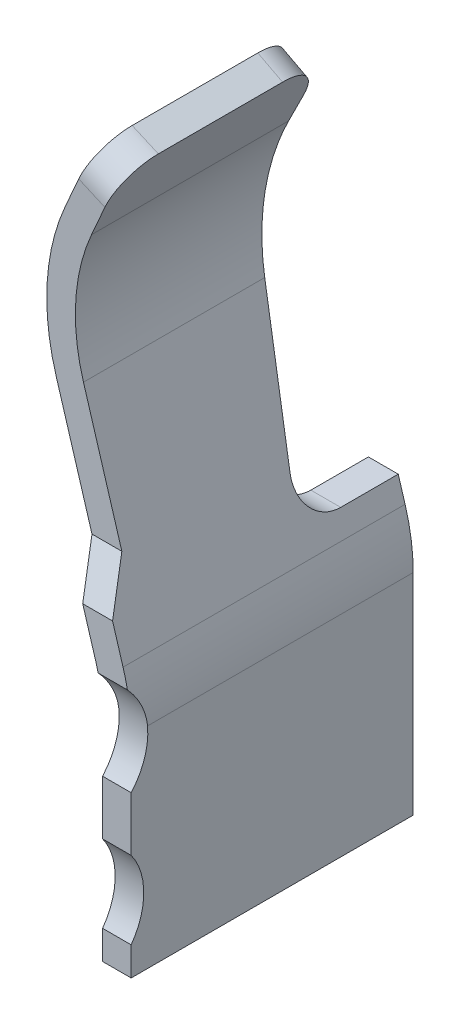
ISO-10303-21;
HEADER;
FILE_DESCRIPTION(('STEP AP214'),'2;1');
FILE_NAME('part.step','',(''),(''),'','','');
FILE_SCHEMA(('AUTOMOTIVE_DESIGN { 1 0 10303 214 1 1 1 1 }'));
ENDSEC;
DATA;
#1=APPLICATION_CONTEXT('core data for automotive mechanical design processes');
#2=APPLICATION_PROTOCOL_DEFINITION('international standard','automotive_design',2000,#1);
#3=PRODUCT_CONTEXT('',#1,'mechanical');
#4=PRODUCT('Part','Part','',(#3));
#5=PRODUCT_RELATED_PRODUCT_CATEGORY('part','',(#4));
#6=PRODUCT_DEFINITION_FORMATION('','',#4);
#7=PRODUCT_DEFINITION_CONTEXT('part definition',#1,'design');
#8=PRODUCT_DEFINITION('design','',#6,#7);
#9=PRODUCT_DEFINITION_SHAPE('','',#8);
#10=(LENGTH_UNIT() NAMED_UNIT(*) SI_UNIT(.MILLI.,.METRE.));
#11=(NAMED_UNIT(*) PLANE_ANGLE_UNIT() SI_UNIT($,.RADIAN.));
#12=(NAMED_UNIT(*) SI_UNIT($,.STERADIAN.) SOLID_ANGLE_UNIT());
#13=UNCERTAINTY_MEASURE_WITH_UNIT(LENGTH_MEASURE(1.E-05),#10,'distance_accuracy_value','');
#14=(GEOMETRIC_REPRESENTATION_CONTEXT(3) GLOBAL_UNCERTAINTY_ASSIGNED_CONTEXT((#13)) GLOBAL_UNIT_ASSIGNED_CONTEXT((#10,
#11,#12)) REPRESENTATION_CONTEXT('',''));
#15=CARTESIAN_POINT('',(0.,0.,0.));
#16=DIRECTION('',(0.,0.,1.));
#17=DIRECTION('',(1.,0.,0.));
#18=AXIS2_PLACEMENT_3D('',#15,#16,#17);
#19=CARTESIAN_POINT('',(-5.74155506681892,3.52330708865174,0.423604352914839));
#20=DIRECTION('',(0.915327071470027,-0.402711251685502,0.));
#21=DIRECTION('',(0.402711251685502,0.915327071470027,0.));
#22=AXIS2_PLACEMENT_3D('',#19,#20,#21);
#23=CYLINDRICAL_SURFACE('',#22,0.2);
#24=CARTESIAN_POINT('',(-5.74155506681892,3.52330708865174,0.423604352914839));
#25=DIRECTION('',(-0.915327071470027,0.402711251685502,0.));
#26=DIRECTION('',(0.402711251685502,0.915327071470027,0.));
#27=AXIS2_PLACEMENT_3D('',#24,#25,#26);
#28=CIRCLE('',#27,0.2);
#29=CARTESIAN_POINT('',(-5.74155506681892,3.52330708865174,0.623604352914839));
#30=VERTEX_POINT('',#29);
#31=CARTESIAN_POINT('',(-5.66101281648182,3.70637250294574,0.423604352914839));
#32=VERTEX_POINT('',#31);
#33=EDGE_CURVE('E399',#30,#32,#28,.T.);
#34=ORIENTED_EDGE('',*,*,#33,.F.);
#35=DIRECTION('',(-0.915327071470027,0.402711251685503,0.));
#36=VECTOR('',#35,1.);
#37=CARTESIAN_POINT('',(-30.3515059297135,14.3508073613119,0.623604352914805));
#38=LINE('',#37,#36);
#39=CARTESIAN_POINT('',(-5.60425600609842,3.46290040089891,0.623604352914839));
#40=VERTEX_POINT('',#39);
#41=EDGE_CURVE('E27',#40,#30,#38,.T.);
#42=ORIENTED_EDGE('',*,*,#41,.F.);
#43=CARTESIAN_POINT('',(-5.60425600609842,3.46290040089891,0.423604352914839));
#44=DIRECTION('',(0.915327071470027,-0.402711251685502,0.));
#45=DIRECTION('',(-0.402711251685502,-0.915327071470027,0.));
#46=AXIS2_PLACEMENT_3D('',#43,#44,#45);
#47=CIRCLE('',#46,0.2);
#48=CARTESIAN_POINT('',(-5.52371375576132,3.64596581519291,0.423604352914839));
#49=VERTEX_POINT('',#48);
#50=EDGE_CURVE('E318',#49,#40,#47,.T.);
#51=ORIENTED_EDGE('',*,*,#50,.F.);
#52=DIRECTION('',(0.915327071470027,-0.402711251685503,0.));
#53=VECTOR('',#52,1.);
#54=CARTESIAN_POINT('',(-5.66101281648182,3.70637250294574,0.423604352914839));
#55=LINE('',#54,#53);
#56=EDGE_CURVE('E342',#32,#49,#55,.T.);
#57=ORIENTED_EDGE('',*,*,#56,.F.);
#58=EDGE_LOOP('',(#34,#42,#51,#57));
#59=FACE_BOUND('',#58,.T.);
#60=ADVANCED_FACE('F16',(#59),#23,.T.);
#61=CARTESIAN_POINT('',(-5.76386274132999,3.53312166947706,-0.236832722369337));
#62=DIRECTION('',(-0.914255270392899,0.402239697454472,-0.0483789866630451));
#63=DIRECTION('',(-0.402711251685501,-0.915327071470027,0.));
#64=AXIS2_PLACEMENT_3D('',#61,#62,#63);
#65=CYLINDRICAL_SURFACE('',#64,0.2);
#66=CARTESIAN_POINT('',(-5.61305946195423,3.44289092405021,-0.427421697659668));
#67=CARTESIAN_POINT('',(-5.56198253480763,3.55898426375477,-0.441384710680955));
#68=CARTESIAN_POINT('',(-5.52371375576131,3.64596581519291,-0.356133634256613));
#69=CARTESIAN_POINT('',(-5.52371375576131,3.64596581519291,-0.228386927890316));
#70=(BOUNDED_CURVE() B_SPLINE_CURVE(3,(#66,#67,#68,#69),.UNSPECIFIED.,.F.,
.F.) B_SPLINE_CURVE_WITH_KNOTS((4,4),(6.17366415670651,7.85398163397443),
.UNSPECIFIED.) CURVE() GEOMETRIC_REPRESENTATION_ITEM() RATIONAL_B_SPLINE_CURVE((1.,
0.77822974253387,0.77822974253387,1.)) REPRESENTATION_ITEM(''));
#71=CARTESIAN_POINT('',(-5.61305946195423,3.44289092405021,-0.427421697659668));
#72=VERTEX_POINT('',#71);
#73=CARTESIAN_POINT('',(-5.52371375576131,3.64596581519291,-0.228386927890316));
#74=VERTEX_POINT('',#73);
#75=EDGE_CURVE('E371',#72,#74,#70,.T.);
#76=ORIENTED_EDGE('',*,*,#75,.F.);
#77=DIRECTION('',(0.914255270392898,-0.402239697454473,0.0483789866630451));
#78=VECTOR('',#77,1.);
#79=CARTESIAN_POINT('',(-30.951852655037,14.5910558161891,-1.76825633941021));
#80=LINE('',#79,#78);
#81=CARTESIAN_POINT('',(-5.75035852267473,3.50329761180303,-0.434687053017796));
#82=VERTEX_POINT('',#81);
#83=EDGE_CURVE('E11',#82,#72,#80,.T.);
#84=ORIENTED_EDGE('',*,*,#83,.F.);
#85=CARTESIAN_POINT('',(-5.66101281648182,3.70637250294574,-0.235652283248443));
#86=CARTESIAN_POINT('',(-5.66101281648182,3.70637250294574,-0.363398989614741));
#87=CARTESIAN_POINT('',(-5.69928159552814,3.6193909515076,-0.448650066039083));
#88=CARTESIAN_POINT('',(-5.75035852267473,3.50329761180303,-0.434687053017796));
#89=(BOUNDED_CURVE() B_SPLINE_CURVE(3,(#85,#86,#87,#88),.UNSPECIFIED.,.F.,
.F.) B_SPLINE_CURVE_WITH_KNOTS((4,4),(4.71238898038476,6.39270645765268),
.UNSPECIFIED.) CURVE() GEOMETRIC_REPRESENTATION_ITEM() RATIONAL_B_SPLINE_CURVE((1.,
0.77822974253387,0.77822974253387,1.)) REPRESENTATION_ITEM(''));
#90=CARTESIAN_POINT('',(-5.66101281648182,3.70637250294574,-0.235652283248443));
#91=VERTEX_POINT('',#90);
#92=EDGE_CURVE('E267',#91,#82,#89,.T.);
#93=ORIENTED_EDGE('',*,*,#92,.F.);
#94=DIRECTION('',(-0.914255270392898,0.402239697454473,-0.0483789866630451));
#95=VECTOR('',#94,1.);
#96=CARTESIAN_POINT('',(-5.68332049099289,3.71618708377106,-0.236832722369337));
#97=LINE('',#96,#95);
#98=EDGE_CURVE('E339',#74,#91,#97,.T.);
#99=ORIENTED_EDGE('',*,*,#98,.F.);
#100=EDGE_LOOP('',(#76,#84,#93,#99));
#101=FACE_BOUND('',#100,.T.);
#102=ADVANCED_FACE('F529',(#101),#65,.T.);
#103=CARTESIAN_POINT('',(-35.81,1.65634067151207,-0.212546111318104));
#104=DIRECTION('',(0.,-1.,0.));
#105=DIRECTION('',(0.,0.,-1.));
#106=AXIS2_PLACEMENT_3D('',#103,#104,#105);
#107=PLANE('',#106);
#108=DIRECTION('',(0.,0.,-1.));
#109=VECTOR('',#108,1.);
#110=CARTESIAN_POINT('',(-5.58516492105846,1.65634067151207,-0.740000000000018));
#111=LINE('',#110,#109);
#112=CARTESIAN_POINT('',(-5.58516492105846,1.65634067151207,-0.438042305987952));
#113=VERTEX_POINT('',#112);
#114=CARTESIAN_POINT('',(-5.58516492105846,1.65634067151207,-0.740000000000018));
#115=VERTEX_POINT('',#114);
#116=EDGE_CURVE('E323',#113,#115,#111,.T.);
#117=ORIENTED_EDGE('',*,*,#116,.F.);
#118=DIRECTION('',(1.,0.,0.));
#119=VECTOR('',#118,1.);
#120=CARTESIAN_POINT('',(-5.42849659089444,1.65634067151207,-0.438042305987951));
#121=LINE('',#120,#119);
#122=CARTESIAN_POINT('',(-5.42849659089442,1.65634067151207,-0.438042305987951));
#123=VERTEX_POINT('',#122);
#124=EDGE_CURVE('E309',#113,#123,#121,.T.);
#125=ORIENTED_EDGE('',*,*,#124,.T.);
#126=DIRECTION('',(0.,0.,1.));
#127=VECTOR('',#126,1.);
#128=CARTESIAN_POINT('',(-5.42849659089442,1.65634067151207,-0.740000000000018));
#129=LINE('',#128,#127);
#130=CARTESIAN_POINT('',(-5.42849659089442,1.65634067151207,-0.740000000000018));
#131=VERTEX_POINT('',#130);
#132=EDGE_CURVE('E260',#131,#123,#129,.T.);
#133=ORIENTED_EDGE('',*,*,#132,.F.);
#134=DIRECTION('',(-1.,0.,0.));
#135=VECTOR('',#134,1.);
#136=CARTESIAN_POINT('',(-6.35,1.65634067151207,-0.740000000000019));
#137=LINE('',#136,#135);
#138=EDGE_CURVE('E226',#131,#115,#137,.T.);
#139=ORIENTED_EDGE('',*,*,#138,.T.);
#140=EDGE_LOOP('',(#117,#125,#133,#139));
#141=FACE_BOUND('',#140,.T.);
#142=ADVANCED_FACE('F516',(#141),#107,.F.);
#143=CARTESIAN_POINT('',(-35.81,3.70637250294571,-0.459111687165995));
#144=DIRECTION('',(0.,0.119413416546905,0.992844618230162));
#145=DIRECTION('',(1.,0.,0.));
#146=AXIS2_PLACEMENT_3D('',#143,#144,#145);
#147=PLANE('',#146);
#148=DIRECTION('',(-0.28674853992682,0.951150986717314,-0.11439875574724));
#149=VECTOR('',#148,1.);
#150=CARTESIAN_POINT('',(-5.4103360451115,1.59610175610151,-0.205300934614502));
#151=LINE('',#150,#149);
#152=CARTESIAN_POINT('',(-5.49599169256638,1.88022335482146,-0.239473382341919));
#153=VERTEX_POINT('',#152);
#154=CARTESIAN_POINT('',(-5.71658626409634,2.61194022573825,-0.327479914176621));
#155=VERTEX_POINT('',#154);
#156=EDGE_CURVE('E256',#153,#155,#151,.T.);
#157=ORIENTED_EDGE('',*,*,#156,.F.);
#158=DIRECTION('',(-1.,0.,0.));
#159=VECTOR('',#158,1.);
#160=CARTESIAN_POINT('',(-5.58516492105847,1.88022335482146,-0.23947338234192));
#161=LINE('',#160,#159);
#162=CARTESIAN_POINT('',(-5.65266002273041,1.88022335482146,-0.23947338234192));
#163=VERTEX_POINT('',#162);
#164=EDGE_CURVE('E363',#153,#163,#161,.T.);
#165=ORIENTED_EDGE('',*,*,#164,.T.);
#166=DIRECTION('',(0.286748539926818,-0.951150986717315,0.11439875574724));
#167=VECTOR('',#166,1.);
#168=CARTESIAN_POINT('',(-5.55412236488806,1.55337185451571,-0.200161637444145));
#169=LINE('',#168,#167);
#170=CARTESIAN_POINT('',(-5.86020176045379,2.56864369924933,-0.322272466749579));
#171=VERTEX_POINT('',#170);
#172=EDGE_CURVE('E460',#171,#163,#169,.T.);
#173=ORIENTED_EDGE('',*,*,#172,.F.);
#174=CARTESIAN_POINT('',(-5.81177575390392,3.36370167510267,-0.417897288102545));
#175=CARTESIAN_POINT('',(-5.92330079490673,3.11021511680704,-0.387409439934768));
#176=CARTESIAN_POINT('',(-5.94013739459604,2.83379189253285,-0.354162906673266));
#177=CARTESIAN_POINT('',(-5.86020176045379,2.56864369924933,-0.322272466749579));
#178=(BOUNDED_CURVE() B_SPLINE_CURVE(3,(#174,#175,#176,#177),.UNSPECIFIED.,.F.,
.F.) B_SPLINE_CURVE_WITH_KNOTS((4,4),(4.29791199977039,5.00519872138853),
.UNSPECIFIED.) CURVE() GEOMETRIC_REPRESENTATION_ITEM() RATIONAL_B_SPLINE_CURVE((1.,
0.958744787021091,0.958744787021091,1.)) REPRESENTATION_ITEM(''));
#179=CARTESIAN_POINT('',(-5.81177575390392,3.36370167510267,-0.417897288102545));
#180=VERTEX_POINT('',#179);
#181=EDGE_CURVE('E285',#180,#171,#178,.T.);
#182=ORIENTED_EDGE('',*,*,#181,.F.);
#183=DIRECTION('',(-0.400292818236851,-0.909830186054405,0.109428936813832));
#184=VECTOR('',#183,1.);
#185=CARTESIAN_POINT('',(-5.79766648991178,3.39577078475993,-0.421754368938234));
#186=LINE('',#185,#184);
#187=EDGE_CURVE('E263',#82,#180,#186,.T.);
#188=ORIENTED_EDGE('',*,*,#187,.F.);
#189=ORIENTED_EDGE('',*,*,#83,.T.);
#190=DIRECTION('',(0.400292818236852,0.909830186054405,-0.109428936813832));
#191=VECTOR('',#190,1.);
#192=CARTESIAN_POINT('',(-5.66004918034407,3.33608744850051,-0.414576013974332));
#193=LINE('',#192,#191);
#194=CARTESIAN_POINT('',(-5.67447669318342,3.30329498734983,-0.410631932744417));
#195=VERTEX_POINT('',#194);
#196=EDGE_CURVE('E376',#195,#72,#193,.T.);
#197=ORIENTED_EDGE('',*,*,#196,.F.);
#198=CARTESIAN_POINT('',(-5.71658626409634,2.61194022573825,-0.327479914176621));
#199=CARTESIAN_POINT('',(-5.78609551117657,2.84250387207174,-0.355210731501565));
#200=CARTESIAN_POINT('',(-5.7714549897076,3.08287189317973,-0.384120760424611));
#201=CARTESIAN_POINT('',(-5.67447669318342,3.30329498734983,-0.410631932744417));
#202=(BOUNDED_CURVE() B_SPLINE_CURVE(3,(#198,#199,#200,#201),.UNSPECIFIED.,.F.,
.F.) B_SPLINE_CURVE_WITH_KNOTS((4,4),(1.27798658579106,1.98527330740919),
.UNSPECIFIED.) CURVE() GEOMETRIC_REPRESENTATION_ITEM() RATIONAL_B_SPLINE_CURVE((1.,
0.958744787021091,0.958744787021091,1.)) REPRESENTATION_ITEM(''));
#203=EDGE_CURVE('E358',#155,#195,#202,.T.);
#204=ORIENTED_EDGE('',*,*,#203,.F.);
#205=EDGE_LOOP('',(#157,#165,#173,#182,#188,#189,#197,#204));
#206=FACE_BOUND('',#205,.T.);
#207=ADVANCED_FACE('F512',(#206),#147,.F.);
#208=CARTESIAN_POINT('',(-35.81,1.94413292378283,0.623604352914797));
#209=DIRECTION('',(0.,0.,-1.));
#210=DIRECTION('',(0.,-1.,0.));
#211=AXIS2_PLACEMENT_3D('',#208,#209,#210);
#212=PLANE('',#211);
#213=DIRECTION('',(-0.402711251685501,-0.915327071470028,0.));
#214=VECTOR('',#213,1.);
#215=CARTESIAN_POINT('',(-5.67447669318342,3.30329498734984,0.623604352914839));
#216=LINE('',#215,#214);
#217=CARTESIAN_POINT('',(-5.67447669318342,3.30329498734984,0.623604352914839));
#218=VERTEX_POINT('',#217);
#219=EDGE_CURVE('E310',#40,#218,#216,.T.);
#220=ORIENTED_EDGE('',*,*,#219,.F.);
#221=ORIENTED_EDGE('',*,*,#41,.T.);
#222=DIRECTION('',(0.4027112516855,0.915327071470028,0.));
#223=VECTOR('',#222,1.);
#224=CARTESIAN_POINT('',(-5.81177575390392,3.36370167510267,0.623604352914839));
#225=LINE('',#224,#223);
#226=CARTESIAN_POINT('',(-5.81177575390392,3.36370167510267,0.623604352914839));
#227=VERTEX_POINT('',#226);
#228=EDGE_CURVE('E266',#227,#30,#225,.T.);
#229=ORIENTED_EDGE('',*,*,#228,.F.);
#230=CARTESIAN_POINT('',(-4.75914962171339,2.90058373566433,0.62360435291484));
#231=DIRECTION('',(0.,0.,-1.));
#232=DIRECTION('',(-1.,0.,0.));
#233=AXIS2_PLACEMENT_3D('',#230,#231,#232);
#234=CIRCLE('',#233,1.15);
#235=CARTESIAN_POINT('',(-5.86020176045379,2.56864369924933,0.623604352914839));
#236=VERTEX_POINT('',#235);
#237=EDGE_CURVE('E291',#236,#227,#234,.T.);
#238=ORIENTED_EDGE('',*,*,#237,.F.);
#239=DIRECTION('',(-0.288643509926088,0.957436642382956,0.));
#240=VECTOR('',#239,1.);
#241=CARTESIAN_POINT('',(-5.53617885397449,1.49385284836845,0.623604352914839));
#242=LINE('',#241,#240);
#243=CARTESIAN_POINT('',(-5.67192717993568,1.94413292378283,0.623604352914839));
#244=VERTEX_POINT('',#243);
#245=EDGE_CURVE('E279',#244,#236,#242,.T.);
#246=ORIENTED_EDGE('',*,*,#245,.F.);
#247=DIRECTION('',(1.,0.,0.));
#248=VECTOR('',#247,1.);
#249=CARTESIAN_POINT('',(-35.81,1.94413292378283,0.623604352914797));
#250=LINE('',#249,#248);
#251=CARTESIAN_POINT('',(-5.51525884977165,1.94413292378283,0.623604352914839));
#252=VERTEX_POINT('',#251);
#253=EDGE_CURVE('E346',#244,#252,#250,.T.);
#254=ORIENTED_EDGE('',*,*,#253,.T.);
#255=DIRECTION('',(0.28864350992609,-0.957436642382956,0.));
#256=VECTOR('',#255,1.);
#257=CARTESIAN_POINT('',(-5.39256335761705,1.53714937485737,0.623604352914839));
#258=LINE('',#257,#256);
#259=CARTESIAN_POINT('',(-5.71658626409634,2.61194022573825,0.623604352914839));
#260=VERTEX_POINT('',#259);
#261=EDGE_CURVE('E259',#260,#252,#258,.T.);
#262=ORIENTED_EDGE('',*,*,#261,.F.);
#263=CARTESIAN_POINT('',(-4.75914962171339,2.90058373566433,0.62360435291484));
#264=DIRECTION('',(0.,0.,1.));
#265=DIRECTION('',(-1.,0.,0.));
#266=AXIS2_PLACEMENT_3D('',#263,#264,#265);
#267=CIRCLE('',#266,1.);
#268=EDGE_CURVE('E416',#218,#260,#267,.T.);
#269=ORIENTED_EDGE('',*,*,#268,.F.);
#270=EDGE_LOOP('',(#220,#221,#229,#238,#246,#254,#262,#269));
#271=FACE_BOUND('',#270,.T.);
#272=ADVANCED_FACE('F515',(#271),#212,.F.);
#273=CARTESIAN_POINT('',(-35.81,1.7003498353216,0.749999999999972));
#274=DIRECTION('',(0.,-0.460287319631494,-0.887770005906065));
#275=DIRECTION('',(0.,-0.887770005906065,0.460287319631494));
#276=AXIS2_PLACEMENT_3D('',#273,#274,#275);
#277=PLANE('',#276);
#278=DIRECTION('',(-1.,0.,0.));
#279=VECTOR('',#278,1.);
#280=CARTESIAN_POINT('',(-6.35,1.7196371362757,0.739999999999981));
#281=LINE('',#280,#279);
#282=CARTESIAN_POINT('',(-5.44757891232074,1.7196371362757,0.739999999999982));
#283=VERTEX_POINT('',#282);
#284=CARTESIAN_POINT('',(-5.60424724248478,1.7196371362757,0.739999999999982));
#285=VERTEX_POINT('',#284);
#286=EDGE_CURVE('E329',#283,#285,#281,.T.);
#287=ORIENTED_EDGE('',*,*,#286,.F.);
#288=DIRECTION('',(0.258541028225372,-0.857586072334425,0.444637678635293));
#289=VECTOR('',#288,1.);
#290=CARTESIAN_POINT('',(-5.57357656169357,2.13757401070795,0.523309818502748));
#291=LINE('',#290,#289);
#292=EDGE_CURVE('E335',#252,#283,#291,.T.);
#293=ORIENTED_EDGE('',*,*,#292,.F.);
#294=ORIENTED_EDGE('',*,*,#253,.F.);
#295=DIRECTION('',(-0.258541028225371,0.857586072334425,-0.444637678635293));
#296=VECTOR('',#295,1.);
#297=CARTESIAN_POINT('',(-5.7197726380838,2.10283732290249,0.541319952677684));
#298=LINE('',#297,#296);
#299=EDGE_CURVE('E284',#285,#244,#298,.T.);
#300=ORIENTED_EDGE('',*,*,#299,.F.);
#301=EDGE_LOOP('',(#287,#293,#294,#300));
#302=FACE_BOUND('',#301,.T.);
#303=ADVANCED_FACE('F507',(#302),#277,.F.);
#304=CARTESIAN_POINT('',(-6.35,1.24850586493128,0.739999999999981));
#305=DIRECTION('',(0.,0.,-1.));
#306=DIRECTION('',(0.,-1.,0.));
#307=AXIS2_PLACEMENT_3D('',#304,#305,#306);
#308=PLANE('',#307);
#309=DIRECTION('',(0.,-1.,0.));
#310=VECTOR('',#309,1.);
#311=CARTESIAN_POINT('',(-5.35,0.145965815192914,0.739999999999982));
#312=LINE('',#311,#310);
#313=CARTESIAN_POINT('',(-5.35,0.296740599868486,0.739999999999982));
#314=VERTEX_POINT('',#313);
#315=CARTESIAN_POINT('',(-5.35,0.145965815192914,0.739999999999982));
#316=VERTEX_POINT('',#315);
#317=EDGE_CURVE('E227',#314,#316,#312,.T.);
#318=ORIENTED_EDGE('',*,*,#317,.F.);
#319=DIRECTION('',(-1.,0.,0.));
#320=VECTOR('',#319,1.);
#321=CARTESIAN_POINT('',(-35.81,0.296740599868486,0.73999999999994));
#322=LINE('',#321,#320);
#323=CARTESIAN_POINT('',(-5.5,0.296740599868486,0.739999999999982));
#324=VERTEX_POINT('',#323);
#325=EDGE_CURVE('E268',#314,#324,#322,.T.);
#326=ORIENTED_EDGE('',*,*,#325,.T.);
#327=DIRECTION('',(0.,1.,0.));
#328=VECTOR('',#327,1.);
#329=CARTESIAN_POINT('',(-5.5,0.145965815192914,0.739999999999982));
#330=LINE('',#329,#328);
#331=CARTESIAN_POINT('',(-5.5,0.145965815192914,0.739999999999982));
#332=VERTEX_POINT('',#331);
#333=EDGE_CURVE('E278',#332,#324,#330,.T.);
#334=ORIENTED_EDGE('',*,*,#333,.F.);
#335=DIRECTION('',(-1.,0.,0.));
#336=VECTOR('',#335,1.);
#337=CARTESIAN_POINT('',(-5.5,0.145965815192914,0.739999999999982));
#338=LINE('',#337,#336);
#339=EDGE_CURVE('E250',#316,#332,#338,.T.);
#340=ORIENTED_EDGE('',*,*,#339,.F.);
#341=EDGE_LOOP('',(#318,#326,#334,#340));
#342=FACE_BOUND('',#341,.T.);
#343=ADVANCED_FACE('F511',(#342),#308,.F.);
#344=CARTESIAN_POINT('',(-6.35,1.24850586493128,-0.740000000000019));
#345=DIRECTION('',(0.,0.,-1.));
#346=DIRECTION('',(0.,-1.,0.));
#347=AXIS2_PLACEMENT_3D('',#344,#345,#346);
#348=PLANE('',#347);
#349=ORIENTED_EDGE('',*,*,#138,.F.);
#350=DIRECTION('',(0.28864350992609,-0.957436642382956,0.));
#351=VECTOR('',#350,1.);
#352=CARTESIAN_POINT('',(-5.39256335761705,1.53714937485737,-0.740000000000018));
#353=LINE('',#352,#351);
#354=CARTESIAN_POINT('',(-5.39256335761705,1.53714937485737,-0.740000000000018));
#355=VERTEX_POINT('',#354);
#356=EDGE_CURVE('E413',#131,#355,#353,.T.);
#357=ORIENTED_EDGE('',*,*,#356,.T.);
#358=CARTESIAN_POINT('',(-6.35,1.24850586493128,-0.740000000000019));
#359=DIRECTION('',(0.,0.,-1.));
#360=DIRECTION('',(-1.,0.,0.));
#361=AXIS2_PLACEMENT_3D('',#358,#359,#360);
#362=CIRCLE('',#361,1.);
#363=CARTESIAN_POINT('',(-5.35,1.24850586493128,-0.740000000000018));
#364=VERTEX_POINT('',#363);
#365=EDGE_CURVE('E223',#355,#364,#362,.T.);
#366=ORIENTED_EDGE('',*,*,#365,.T.);
#367=DIRECTION('',(0.,-1.,0.));
#368=VECTOR('',#367,1.);
#369=CARTESIAN_POINT('',(-5.35,0.145965815192914,-0.740000000000018));
#370=LINE('',#369,#368);
#371=CARTESIAN_POINT('',(-5.35,0.145965815192914,-0.740000000000018));
#372=VERTEX_POINT('',#371);
#373=EDGE_CURVE('E42',#364,#372,#370,.T.);
#374=ORIENTED_EDGE('',*,*,#373,.T.);
#375=DIRECTION('',(-1.,0.,0.));
#376=VECTOR('',#375,1.);
#377=CARTESIAN_POINT('',(-5.5,0.145965815192914,-0.740000000000018));
#378=LINE('',#377,#376);
#379=CARTESIAN_POINT('',(-5.5,0.145965815192914,-0.740000000000018));
#380=VERTEX_POINT('',#379);
#381=EDGE_CURVE('E220',#372,#380,#378,.T.);
#382=ORIENTED_EDGE('',*,*,#381,.T.);
#383=DIRECTION('',(0.,1.,0.));
#384=VECTOR('',#383,1.);
#385=CARTESIAN_POINT('',(-5.5,0.145965815192914,-0.740000000000018));
#386=LINE('',#385,#384);
#387=CARTESIAN_POINT('',(-5.5,1.24850586493128,-0.740000000000018));
#388=VERTEX_POINT('',#387);
#389=EDGE_CURVE('E293',#380,#388,#386,.T.);
#390=ORIENTED_EDGE('',*,*,#389,.T.);
#391=CARTESIAN_POINT('',(-6.35,1.24850586493128,-0.740000000000019));
#392=DIRECTION('',(0.,0.,1.));
#393=DIRECTION('',(-1.,0.,0.));
#394=AXIS2_PLACEMENT_3D('',#391,#392,#393);
#395=CIRCLE('',#394,0.85);
#396=CARTESIAN_POINT('',(-5.53617885397449,1.49385284836845,-0.740000000000018));
#397=VERTEX_POINT('',#396);
#398=EDGE_CURVE('E277',#388,#397,#395,.T.);
#399=ORIENTED_EDGE('',*,*,#398,.T.);
#400=DIRECTION('',(-0.288643509926088,0.957436642382956,0.));
#401=VECTOR('',#400,1.);
#402=CARTESIAN_POINT('',(-5.53617885397449,1.49385284836845,-0.740000000000018));
#403=LINE('',#402,#401);
#404=EDGE_CURVE('E319',#397,#115,#403,.T.);
#405=ORIENTED_EDGE('',*,*,#404,.T.);
#406=EDGE_LOOP('',(#349,#357,#366,#374,#382,#390,#399,#405));
#407=FACE_BOUND('',#406,.T.);
#408=ADVANCED_FACE('F217',(#407),#348,.T.);
#409=CARTESIAN_POINT('',(-5.35,0.145965815192914,-0.740000000000018));
#410=DIRECTION('',(-1.,0.,0.));
#411=DIRECTION('',(0.,0.,1.));
#412=AXIS2_PLACEMENT_3D('',#409,#410,#411);
#413=PLANE('',#412);
#414=DIRECTION('',(0.,0.,1.));
#415=VECTOR('',#414,1.);
#416=CARTESIAN_POINT('',(-5.35,1.24850586493128,-0.740000000000018));
#417=LINE('',#416,#415);
#418=CARTESIAN_POINT('',(-5.35,1.24850586493128,0.654029100989327));
#419=VERTEX_POINT('',#418);
#420=EDGE_CURVE('E382',#364,#419,#417,.T.);
#421=ORIENTED_EDGE('',*,*,#420,.T.);
#422=CARTESIAN_POINT('',(-5.35,1.21669179396546,0.995153761033099));
#423=DIRECTION('',(1.,0.,0.));
#424=DIRECTION('',(0.,0.,1.));
#425=AXIS2_PLACEMENT_3D('',#422,#423,#424);
#426=CIRCLE('',#425,0.342604974863759);
#427=CARTESIAN_POINT('',(-5.35,0.988055123608201,0.739999999999982));
#428=VERTEX_POINT('',#427);
#429=EDGE_CURVE('E567',#428,#419,#426,.T.);
#430=ORIENTED_EDGE('',*,*,#429,.F.);
#431=DIRECTION('',(0.,-1.,0.));
#432=VECTOR('',#431,1.);
#433=CARTESIAN_POINT('',(-5.35,0.145965815192914,0.739999999999982));
#434=LINE('',#433,#432);
#435=CARTESIAN_POINT('',(-5.35,0.703259400131467,0.739999999999982));
#436=VERTEX_POINT('',#435);
#437=EDGE_CURVE('E453',#428,#436,#434,.T.);
#438=ORIENTED_EDGE('',*,*,#437,.T.);
#439=CARTESIAN_POINT('',(-5.35,0.499999999999977,1.01942683457021));
#440=DIRECTION('',(1.,0.,0.));
#441=DIRECTION('',(0.,0.,1.));
#442=AXIS2_PLACEMENT_3D('',#439,#440,#441);
#443=CIRCLE('',#442,0.345533991988848);
#444=EDGE_CURVE('E272',#314,#436,#443,.T.);
#445=ORIENTED_EDGE('',*,*,#444,.F.);
#446=ORIENTED_EDGE('',*,*,#317,.T.);
#447=DIRECTION('',(0.,0.,1.));
#448=VECTOR('',#447,1.);
#449=CARTESIAN_POINT('',(-5.35,0.145965815192914,-0.740000000000018));
#450=LINE('',#449,#448);
#451=EDGE_CURVE('E231',#372,#316,#450,.T.);
#452=ORIENTED_EDGE('',*,*,#451,.F.);
#453=ORIENTED_EDGE('',*,*,#373,.F.);
#454=EDGE_LOOP('',(#421,#430,#438,#445,#446,#452,#453));
#455=FACE_BOUND('',#454,.T.);
#456=ADVANCED_FACE('F232',(#455),#413,.F.);
#457=CARTESIAN_POINT('',(-6.35,1.24850586493128,-0.740000000000019));
#458=DIRECTION('',(0.,0.,1.));
#459=DIRECTION('',(1.,0.,0.));
#460=AXIS2_PLACEMENT_3D('',#457,#458,#459);
#461=CYLINDRICAL_SURFACE('',#460,1.);
#462=CARTESIAN_POINT('',(-6.35,1.24850586493128,0.739999999999981));
#463=DIRECTION('',(0.,0.,-1.));
#464=DIRECTION('',(-1.,0.,0.));
#465=AXIS2_PLACEMENT_3D('',#462,#463,#464);
#466=CIRCLE('',#465,1.);
#467=CARTESIAN_POINT('',(-5.39256335761705,1.53714937485737,0.739999999999982));
#468=VERTEX_POINT('',#467);
#469=CARTESIAN_POINT('',(-5.36956088186528,1.44532846432271,0.739999999999982));
#470=VERTEX_POINT('',#469);
#471=EDGE_CURVE('E477',#468,#470,#466,.T.);
#472=ORIENTED_EDGE('',*,*,#471,.T.);
#473=CARTESIAN_POINT('',(-5.36956088186528,1.44532846432271,0.739999999999982));
#474=CARTESIAN_POINT('',(-5.36887868258316,1.44193024717417,0.736954698545496));
#475=CARTESIAN_POINT('',(-5.36820278149149,1.43847176034264,0.733975045899673));
#476=CARTESIAN_POINT('',(-5.366871440474,1.43145643098159,0.728168909339876));
#477=CARTESIAN_POINT('',(-5.36621591068375,1.42790021102154,0.725341693611786));
#478=CARTESIAN_POINT('',(-5.36492831183025,1.42068928784943,0.719840380711082));
#479=CARTESIAN_POINT('',(-5.36429616172075,1.41703501951577,0.71716573280542));
#480=CARTESIAN_POINT('',(-5.3630584278734,1.40962817005605,0.711969336935208));
#481=CARTESIAN_POINT('',(-5.36245278447869,1.40587584366106,0.709447240161664));
#482=CARTESIAN_POINT('',(-5.36127122870312,1.39827302810691,0.704555749407203));
#483=CARTESIAN_POINT('',(-5.36069529111151,1.3944226264712,0.702186225501798));
#484=CARTESIAN_POINT('',(-5.359576382774,1.38662388081493,0.697599649617223));
#485=CARTESIAN_POINT('',(-5.3590334341832,1.38267547342748,0.695382699975703));
#486=CARTESIAN_POINT('',(-5.35798380395004,1.37468096295891,0.691101059928101));
#487=CARTESIAN_POINT('',(-5.35747720426113,1.37063466501766,0.689036713287234));
#488=CARTESIAN_POINT('',(-5.35650364840602,1.36244473872734,0.685059955148872));
#489=CARTESIAN_POINT('',(-5.35603684560395,1.35830080604148,0.683148133100298));
#490=CARTESIAN_POINT('',(-5.35514614898274,1.34991442649087,0.679475891500459));
#491=CARTESIAN_POINT('',(-5.35472250492898,1.34567156354324,0.677716361222166));
#492=CARTESIAN_POINT('',(-5.35392647194206,1.33713872195216,0.674376033868776));
#493=CARTESIAN_POINT('',(-5.35355381064897,1.33284913740271,0.672794295796527));
#494=CARTESIAN_POINT('',(-5.35286136145208,1.32422362544486,0.669809238507249));
#495=CARTESIAN_POINT('',(-5.35254136585005,1.31988795555424,0.668405223722618));
#496=CARTESIAN_POINT('',(-5.35195585588988,1.3111710125325,0.665775382478355));
#497=CARTESIAN_POINT('',(-5.35169020857531,1.30678987892384,0.664549123358638));
#498=CARTESIAN_POINT('',(-5.35121500632154,1.29798278695399,0.662274523841769));
#499=CARTESIAN_POINT('',(-5.35100540203927,1.29355687160846,0.661226027233375));
#500=CARTESIAN_POINT('',(-5.35064388775924,1.28466100981375,0.659306657193404));
#501=CARTESIAN_POINT('',(-5.35049201945117,1.28019103392983,0.65843591232121));
#502=CARTESIAN_POINT('',(-5.35024760848128,1.27120787033427,0.656871822149784));
#503=CARTESIAN_POINT('',(-5.35015520429872,1.26669460642052,0.65617889318396));
#504=CARTESIAN_POINT('',(-5.35003124362393,1.25762568522579,0.654969909316688));
#505=CARTESIAN_POINT('',(-5.34999992587799,1.25306993125335,0.654454554866671));
#506=CARTESIAN_POINT('',(-5.35,1.24850586493128,0.654029100989326));
#507=B_SPLINE_CURVE_WITH_KNOTS('',3,(#473,#474,#475,#476,#477,#478,#479,#480,#481,#482,#483,
#484,#485,#486,#487,#488,#489,#490,#491,#492,#493,#494,#495,#496,#497,#498,#499,#500,#501,#502,
#503,#504,#505,#506),.UNSPECIFIED.,.F.,.F.,(4,2,2,2,2,2,2,2,2,2,2,2,2,2,2,2,4),(0.,
0.0138407212062309,0.0276076629971236,0.0413212735161823,0.0550022400254226,0.0686713979831095,
0.082349636792079,0.0960578043229839,0.109816612381106,0.123650992269108,0.137408310969834,
0.151110002599701,0.164777762982982,0.178433449670465,0.192098978145581,0.205796216649571,
0.219546882133365),.UNSPECIFIED.);
#508=EDGE_CURVE('E570',#470,#419,#507,.T.);
#509=ORIENTED_EDGE('',*,*,#508,.T.);
#510=ORIENTED_EDGE('',*,*,#420,.F.);
#511=ORIENTED_EDGE('',*,*,#365,.F.);
#512=DIRECTION('',(0.,0.,1.));
#513=VECTOR('',#512,1.);
#514=CARTESIAN_POINT('',(-5.39256335761705,1.53714937485737,-0.740000000000018));
#515=LINE('',#514,#513);
#516=EDGE_CURVE('E421',#355,#468,#515,.T.);
#517=ORIENTED_EDGE('',*,*,#516,.T.);
#518=EDGE_LOOP('',(#472,#509,#510,#511,#517));
#519=FACE_BOUND('',#518,.T.);
#520=ADVANCED_FACE('F850',(#519),#461,.T.);
#521=CARTESIAN_POINT('',(-5.39256335761705,1.53714937485737,-0.740000000000018));
#522=DIRECTION('',(-0.957436642382956,-0.28864350992609,0.));
#523=DIRECTION('',(-0.28864350992609,0.957436642382956,0.));
#524=AXIS2_PLACEMENT_3D('',#521,#522,#523);
#525=PLANE('',#524);
#526=ORIENTED_EDGE('',*,*,#356,.F.);
#527=ORIENTED_EDGE('',*,*,#132,.T.);
#528=CARTESIAN_POINT('',(-5.42849659089442,1.65634067151207,-0.438042305987951));
#529=CARTESIAN_POINT('',(-5.42849659089442,1.65634067151208,-0.320885018462571));
#530=CARTESIAN_POINT('',(-5.45347162343648,1.73918338398669,-0.238042305987951));
#531=CARTESIAN_POINT('',(-5.48879165317816,1.85634067151208,-0.238042305987952));
#532=(BOUNDED_CURVE() B_SPLINE_CURVE(3,(#528,#529,#530,#531),.UNSPECIFIED.,.F.,
.F.) B_SPLINE_CURVE_WITH_KNOTS((4,4),(3.1415926535898,4.71238898038469),
.UNSPECIFIED.) CURVE() GEOMETRIC_REPRESENTATION_ITEM() RATIONAL_B_SPLINE_CURVE((1.,
0.804737854124365,0.804737854124365,1.)) REPRESENTATION_ITEM(''));
#533=CARTESIAN_POINT('',(-5.48879165317816,1.85634067151208,-0.238042305987952));
#534=VERTEX_POINT('',#533);
#535=EDGE_CURVE('E392',#123,#534,#532,.T.);
#536=ORIENTED_EDGE('',*,*,#535,.T.);
#537=CARTESIAN_POINT('',(-5.48879165317816,1.85634067151208,-0.238042305987952));
#538=CARTESIAN_POINT('',(-5.49119884441548,1.86432537588468,-0.238042305987952));
#539=CARTESIAN_POINT('',(-5.49360172570135,1.87229578405696,-0.23851990151267));
#540=CARTESIAN_POINT('',(-5.49599169256638,1.88022335482146,-0.239473382341919));
#541=(BOUNDED_CURVE() B_SPLINE_CURVE(3,(#537,#538,#539,#540),.UNSPECIFIED.,.F.,
.F.) B_SPLINE_CURVE_WITH_KNOTS((4,4),(4.71238898038469,4.83208803082147),
.UNSPECIFIED.) CURVE() GEOMETRIC_REPRESENTATION_ITEM() RATIONAL_B_SPLINE_CURVE((1.,
0.998806367803328,0.998806367803328,1.)) REPRESENTATION_ITEM(''));
#542=EDGE_CURVE('E386',#534,#153,#541,.T.);
#543=ORIENTED_EDGE('',*,*,#542,.T.);
#544=ORIENTED_EDGE('',*,*,#156,.T.);
#545=DIRECTION('',(0.,0.,1.));
#546=VECTOR('',#545,1.);
#547=CARTESIAN_POINT('',(-5.71658626409634,2.61194022573825,-0.740000000000018));
#548=LINE('',#547,#546);
#549=EDGE_CURVE('E354',#155,#260,#548,.T.);
#550=ORIENTED_EDGE('',*,*,#549,.T.);
#551=ORIENTED_EDGE('',*,*,#261,.T.);
#552=ORIENTED_EDGE('',*,*,#292,.T.);
#553=DIRECTION('',(0.28864350992609,-0.957436642382956,0.));
#554=VECTOR('',#553,1.);
#555=CARTESIAN_POINT('',(-5.39256335761705,1.53714937485737,0.739999999999982));
#556=LINE('',#555,#554);
#557=EDGE_CURVE('E350',#283,#468,#556,.T.);
#558=ORIENTED_EDGE('',*,*,#557,.T.);
#559=ORIENTED_EDGE('',*,*,#516,.F.);
#560=EDGE_LOOP('',(#526,#527,#536,#543,#544,#550,#551,#552,#558,#559));
#561=FACE_BOUND('',#560,.T.);
#562=ADVANCED_FACE('F522',(#561),#525,.F.);
#563=CARTESIAN_POINT('',(-4.75914962171339,2.90058373566433,-0.740000000000017));
#564=DIRECTION('',(0.,0.,1.));
#565=DIRECTION('',(1.,0.,0.));
#566=AXIS2_PLACEMENT_3D('',#563,#564,#565);
#567=CYLINDRICAL_SURFACE('',#566,1.);
#568=ORIENTED_EDGE('',*,*,#549,.F.);
#569=ORIENTED_EDGE('',*,*,#203,.T.);
#570=DIRECTION('',(0.,0.,1.));
#571=VECTOR('',#570,1.);
#572=CARTESIAN_POINT('',(-5.67447669318342,3.30329498734983,-0.740000000000018));
#573=LINE('',#572,#571);
#574=EDGE_CURVE('E317',#195,#218,#573,.T.);
#575=ORIENTED_EDGE('',*,*,#574,.T.);
#576=ORIENTED_EDGE('',*,*,#268,.T.);
#577=EDGE_LOOP('',(#568,#569,#575,#576));
#578=FACE_BOUND('',#577,.T.);
#579=ADVANCED_FACE('F518',(#578),#567,.F.);
#580=CARTESIAN_POINT('',(-5.67447669318342,3.30329498734984,-0.740000000000018));
#581=DIRECTION('',(-0.915327071470028,0.402711251685501,0.));
#582=DIRECTION('',(0.,0.,1.));
#583=AXIS2_PLACEMENT_3D('',#580,#581,#582);
#584=PLANE('',#583);
#585=ORIENTED_EDGE('',*,*,#196,.T.);
#586=ORIENTED_EDGE('',*,*,#75,.T.);
#587=DIRECTION('',(0.,0.,1.));
#588=VECTOR('',#587,1.);
#589=CARTESIAN_POINT('',(-5.52371375576131,3.64596581519291,-0.740000000000018));
#590=LINE('',#589,#588);
#591=EDGE_CURVE('E343',#74,#49,#590,.T.);
#592=ORIENTED_EDGE('',*,*,#591,.T.);
#593=ORIENTED_EDGE('',*,*,#50,.T.);
#594=ORIENTED_EDGE('',*,*,#219,.T.);
#595=ORIENTED_EDGE('',*,*,#574,.F.);
#596=EDGE_LOOP('',(#585,#586,#592,#593,#594,#595));
#597=FACE_BOUND('',#596,.T.);
#598=ADVANCED_FACE('F521',(#597),#584,.F.);
#599=CARTESIAN_POINT('',(-5.66101281648182,3.70637250294574,-0.740000000000018));
#600=DIRECTION('',(-0.402711251685503,-0.915327071470027,0.));
#601=DIRECTION('',(-0.915327071470027,0.402711251685503,0.));
#602=AXIS2_PLACEMENT_3D('',#599,#600,#601);
#603=PLANE('',#602);
#604=ORIENTED_EDGE('',*,*,#591,.F.);
#605=ORIENTED_EDGE('',*,*,#98,.T.);
#606=DIRECTION('',(0.,0.,1.));
#607=VECTOR('',#606,1.);
#608=CARTESIAN_POINT('',(-5.66101281648182,3.70637250294574,-0.740000000000018));
#609=LINE('',#608,#607);
#610=EDGE_CURVE('E254',#91,#32,#609,.T.);
#611=ORIENTED_EDGE('',*,*,#610,.T.);
#612=ORIENTED_EDGE('',*,*,#56,.T.);
#613=EDGE_LOOP('',(#604,#605,#611,#612));
#614=FACE_BOUND('',#613,.T.);
#615=ADVANCED_FACE('F534',(#614),#603,.F.);
#616=CARTESIAN_POINT('',(-5.81177575390392,3.36370167510267,-0.740000000000018));
#617=DIRECTION('',(0.915327071470028,-0.4027112516855,0.));
#618=DIRECTION('',(0.,0.,-1.));
#619=AXIS2_PLACEMENT_3D('',#616,#617,#618);
#620=PLANE('',#619);
#621=ORIENTED_EDGE('',*,*,#610,.F.);
#622=ORIENTED_EDGE('',*,*,#92,.T.);
#623=ORIENTED_EDGE('',*,*,#187,.T.);
#624=DIRECTION('',(0.,0.,1.));
#625=VECTOR('',#624,1.);
#626=CARTESIAN_POINT('',(-5.81177575390392,3.36370167510267,-0.740000000000018));
#627=LINE('',#626,#625);
#628=EDGE_CURVE('E292',#180,#227,#627,.T.);
#629=ORIENTED_EDGE('',*,*,#628,.T.);
#630=ORIENTED_EDGE('',*,*,#228,.T.);
#631=ORIENTED_EDGE('',*,*,#33,.T.);
#632=EDGE_LOOP('',(#621,#622,#623,#629,#630,#631));
#633=FACE_BOUND('',#632,.T.);
#634=ADVANCED_FACE('F536',(#633),#620,.F.);
#635=CARTESIAN_POINT('',(-4.75914962171339,2.90058373566433,-0.740000000000017));
#636=DIRECTION('',(0.,0.,1.));
#637=DIRECTION('',(1.,0.,0.));
#638=AXIS2_PLACEMENT_3D('',#635,#636,#637);
#639=CYLINDRICAL_SURFACE('',#638,1.15);
#640=ORIENTED_EDGE('',*,*,#628,.F.);
#641=ORIENTED_EDGE('',*,*,#181,.T.);
#642=DIRECTION('',(0.,0.,1.));
#643=VECTOR('',#642,1.);
#644=CARTESIAN_POINT('',(-5.86020176045379,2.56864369924933,-0.740000000000019));
#645=LINE('',#644,#643);
#646=EDGE_CURVE('E283',#171,#236,#645,.T.);
#647=ORIENTED_EDGE('',*,*,#646,.T.);
#648=ORIENTED_EDGE('',*,*,#237,.T.);
#649=EDGE_LOOP('',(#640,#641,#647,#648));
#650=FACE_BOUND('',#649,.T.);
#651=ADVANCED_FACE('F862',(#650),#639,.T.);
#652=CARTESIAN_POINT('',(-5.53617885397449,1.49385284836845,-0.740000000000018));
#653=DIRECTION('',(0.957436642382956,0.288643509926088,0.));
#654=DIRECTION('',(0.,0.,-1.));
#655=AXIS2_PLACEMENT_3D('',#652,#653,#654);
#656=PLANE('',#655);
#657=ORIENTED_EDGE('',*,*,#172,.T.);
#658=CARTESIAN_POINT('',(-5.65266002273041,1.88022335482146,-0.23947338234192));
#659=CARTESIAN_POINT('',(-5.65027005586539,1.87229578405696,-0.23851990151267));
#660=CARTESIAN_POINT('',(-5.64786717457952,1.86432537588468,-0.238042305987952));
#661=CARTESIAN_POINT('',(-5.6454599833422,1.85634067151208,-0.238042305987952));
#662=(BOUNDED_CURVE() B_SPLINE_CURVE(3,(#658,#659,#660,#661),.UNSPECIFIED.,.F.,
.F.) B_SPLINE_CURVE_WITH_KNOTS((4,4),(1.45109727635811,1.5707963267949),
.UNSPECIFIED.) CURVE() GEOMETRIC_REPRESENTATION_ITEM() RATIONAL_B_SPLINE_CURVE((1.,
0.998806367803328,0.998806367803328,1.)) REPRESENTATION_ITEM(''));
#663=CARTESIAN_POINT('',(-5.6454599833422,1.85634067151208,-0.238042305987952));
#664=VERTEX_POINT('',#663);
#665=EDGE_CURVE('E308',#163,#664,#662,.T.);
#666=ORIENTED_EDGE('',*,*,#665,.T.);
#667=CARTESIAN_POINT('',(-5.6454599833422,1.85634067151208,-0.238042305987952));
#668=CARTESIAN_POINT('',(-5.61013995360051,1.73918338398669,-0.238042305987952));
#669=CARTESIAN_POINT('',(-5.58516492105846,1.65634067151208,-0.320885018462571));
#670=CARTESIAN_POINT('',(-5.58516492105846,1.65634067151207,-0.438042305987952));
#671=(BOUNDED_CURVE() B_SPLINE_CURVE(3,(#667,#668,#669,#670),.UNSPECIFIED.,.F.,
.F.) B_SPLINE_CURVE_WITH_KNOTS((4,4),(1.5707963267949,3.1415926535898),
.UNSPECIFIED.) CURVE() GEOMETRIC_REPRESENTATION_ITEM() RATIONAL_B_SPLINE_CURVE((1.,
0.804737854124365,0.804737854124365,1.)) REPRESENTATION_ITEM(''));
#672=EDGE_CURVE('E302',#664,#113,#671,.T.);
#673=ORIENTED_EDGE('',*,*,#672,.T.);
#674=ORIENTED_EDGE('',*,*,#116,.T.);
#675=ORIENTED_EDGE('',*,*,#404,.F.);
#676=DIRECTION('',(0.,0.,1.));
#677=VECTOR('',#676,1.);
#678=CARTESIAN_POINT('',(-5.53617885397449,1.49385284836845,-0.740000000000018));
#679=LINE('',#678,#677);
#680=CARTESIAN_POINT('',(-5.53617885397449,1.49385284836845,0.739999999999982));
#681=VERTEX_POINT('',#680);
#682=EDGE_CURVE('E274',#397,#681,#679,.T.);
#683=ORIENTED_EDGE('',*,*,#682,.T.);
#684=DIRECTION('',(-0.288643509926088,0.957436642382956,0.));
#685=VECTOR('',#684,1.);
#686=CARTESIAN_POINT('',(-5.53617885397449,1.49385284836845,0.739999999999982));
#687=LINE('',#686,#685);
#688=EDGE_CURVE('E324',#681,#285,#687,.T.);
#689=ORIENTED_EDGE('',*,*,#688,.T.);
#690=ORIENTED_EDGE('',*,*,#299,.T.);
#691=ORIENTED_EDGE('',*,*,#245,.T.);
#692=ORIENTED_EDGE('',*,*,#646,.F.);
#693=EDGE_LOOP('',(#657,#666,#673,#674,#675,#683,#689,#690,#691,#692));
#694=FACE_BOUND('',#693,.T.);
#695=ADVANCED_FACE('F506',(#694),#656,.F.);
#696=CARTESIAN_POINT('',(-6.35,1.24850586493128,-0.740000000000019));
#697=DIRECTION('',(0.,0.,1.));
#698=DIRECTION('',(1.,0.,0.));
#699=AXIS2_PLACEMENT_3D('',#696,#697,#698);
#700=CYLINDRICAL_SURFACE('',#699,0.85);
#701=DIRECTION('',(0.,0.,1.));
#702=VECTOR('',#701,1.);
#703=CARTESIAN_POINT('',(-5.5,1.24850586493128,-0.740000000000018));
#704=LINE('',#703,#702);
#705=CARTESIAN_POINT('',(-5.5,1.24850586493128,0.654029100989327));
#706=VERTEX_POINT('',#705);
#707=EDGE_CURVE('E238',#388,#706,#704,.T.);
#708=ORIENTED_EDGE('',*,*,#707,.T.);
#709=CARTESIAN_POINT('',(-5.5,1.24850586493128,0.654029100989326));
#710=CARTESIAN_POINT('',(-5.49999991209808,1.25307172693062,0.654454720262644));
#711=CARTESIAN_POINT('',(-5.50003678605821,1.25762924392969,0.654970441218018));
#712=CARTESIAN_POINT('',(-5.50018276310791,1.26670316475236,0.656180580970941));
#713=CARTESIAN_POINT('',(-5.50029161428366,1.27121965647069,0.656874371378022));
#714=CARTESIAN_POINT('',(-5.5005795966021,1.28021043459151,0.658440607166871));
#715=CARTESIAN_POINT('',(-5.50075859333337,1.28468478505171,0.659312709351908));
#716=CARTESIAN_POINT('',(-5.50118479027863,1.29359026706902,0.661235215653648));
#717=CARTESIAN_POINT('',(-5.50143196922435,1.29802141165794,0.66228556413021));
#718=CARTESIAN_POINT('',(-5.50199249708052,1.30683955789747,0.664564290110274));
#719=CARTESIAN_POINT('',(-5.5023059308903,1.31122649527102,0.665792895393329));
#720=CARTESIAN_POINT('',(-5.50299693645541,1.31995538303768,0.668427852265553));
#721=CARTESIAN_POINT('',(-5.50337469034791,1.32429716745912,0.669834705627354));
#722=CARTESIAN_POINT('',(-5.50419232362274,1.33293499859273,0.672825870710009));
#723=CARTESIAN_POINT('',(-5.50463247178103,1.33723075608391,0.674410943694386));
#724=CARTESIAN_POINT('',(-5.50557288956928,1.34577581205573,0.677758358644027));
#725=CARTESIAN_POINT('',(-5.50607350264201,1.35002467970638,0.679521703002872));
#726=CARTESIAN_POINT('',(-5.50712469332697,1.35841002700116,0.683196490683918));
#727=CARTESIAN_POINT('',(-5.50767483337837,1.36254713822207,0.685106618702855));
#728=CARTESIAN_POINT('',(-5.50882244078361,1.37072413591772,0.689079813923085));
#729=CARTESIAN_POINT('',(-5.50941975265843,1.37476428891414,0.691142377362024));
#730=CARTESIAN_POINT('',(-5.51065765882709,1.3827471465994,0.695420264461897));
#731=CARTESIAN_POINT('',(-5.51129817809432,1.38669000475737,0.697635323455948));
#732=CARTESIAN_POINT('',(-5.5126185655259,1.39447822720173,0.702217943435933));
#733=CARTESIAN_POINT('',(-5.5132984257206,1.39832361100898,0.70458547354531));
#734=CARTESIAN_POINT('',(-5.51469366221942,1.40591692940894,0.709472808735524));
#735=CARTESIAN_POINT('',(-5.515409083347,1.40966473145082,0.711992806913177));
#736=CARTESIAN_POINT('',(-5.51687171890919,1.41706305442132,0.717184847198366));
#737=CARTESIAN_POINT('',(-5.51761901622157,1.42071327585295,0.719857292618804));
#738=CARTESIAN_POINT('',(-5.51914177726432,1.42791663066809,0.725354048734377));
#739=CARTESIAN_POINT('',(-5.51991734709402,1.43146928614048,0.728178955935307));
#740=CARTESIAN_POINT('',(-5.52149317809701,1.43847803402667,0.733980340906895));
#741=CARTESIAN_POINT('',(-5.52229355440362,1.44193346413611,0.736957587769658));
#742=CARTESIAN_POINT('',(-5.5231016601971,1.44532846432271,0.739999999999982));
#743=B_SPLINE_CURVE_WITH_KNOTS('',3,(#709,#710,#711,#712,#713,#714,#715,#716,#717,#718,#719,
#720,#721,#722,#723,#724,#725,#726,#727,#728,#729,#730,#731,#732,#733,#734,#735,#736,#737,#738,
#739,#740,#741,#742),.UNSPECIFIED.,.F.,.F.,(4,2,2,2,2,2,2,2,2,2,2,2,2,2,2,2,4),(0.,
0.0137560099805362,0.0274641281891525,0.0411461066327579,0.0548238220332941,0.0685191715441684,
0.0822539679800382,0.0960498370490565,0.109928118966885,0.123693986122693,0.1374162362928,
0.151115243353943,0.164811484932924,0.178525451067853,0.192277552593102,0.206088031282373,
0.219976873694123),.UNSPECIFIED.);
#744=CARTESIAN_POINT('',(-5.5231016601971,1.44532846432271,0.739999999999982));
#745=VERTEX_POINT('',#744);
#746=EDGE_CURVE('E467',#706,#745,#743,.T.);
#747=ORIENTED_EDGE('',*,*,#746,.T.);
#748=CARTESIAN_POINT('',(-6.35,1.24850586493128,0.739999999999981));
#749=DIRECTION('',(0.,0.,1.));
#750=DIRECTION('',(-1.,0.,0.));
#751=AXIS2_PLACEMENT_3D('',#748,#749,#750);
#752=CIRCLE('',#751,0.85);
#753=EDGE_CURVE('E328',#745,#681,#752,.T.);
#754=ORIENTED_EDGE('',*,*,#753,.T.);
#755=ORIENTED_EDGE('',*,*,#682,.F.);
#756=ORIENTED_EDGE('',*,*,#398,.F.);
#757=EDGE_LOOP('',(#708,#747,#754,#755,#756));
#758=FACE_BOUND('',#757,.T.);
#759=ADVANCED_FACE('F495',(#758),#700,.F.);
#760=CARTESIAN_POINT('',(-5.5,0.145965815192914,-0.740000000000018));
#761=DIRECTION('',(1.,0.,0.));
#762=DIRECTION('',(0.,0.,1.));
#763=AXIS2_PLACEMENT_3D('',#760,#761,#762);
#764=PLANE('',#763);
#765=DIRECTION('',(0.,1.,0.));
#766=VECTOR('',#765,1.);
#767=CARTESIAN_POINT('',(-5.5,0.145965815192914,0.739999999999982));
#768=LINE('',#767,#766);
#769=CARTESIAN_POINT('',(-5.5,0.703259400131467,0.739999999999982));
#770=VERTEX_POINT('',#769);
#771=CARTESIAN_POINT('',(-5.5,0.988055123608201,0.739999999999982));
#772=VERTEX_POINT('',#771);
#773=EDGE_CURVE('E353',#770,#772,#768,.T.);
#774=ORIENTED_EDGE('',*,*,#773,.T.);
#775=CARTESIAN_POINT('',(-5.5,1.21669179396546,0.995153761033099));
#776=DIRECTION('',(1.,0.,0.));
#777=DIRECTION('',(0.,0.,-1.));
#778=AXIS2_PLACEMENT_3D('',#775,#776,#777);
#779=CIRCLE('',#778,0.342604974863759);
#780=EDGE_CURVE('E370',#772,#706,#779,.T.);
#781=ORIENTED_EDGE('',*,*,#780,.T.);
#782=ORIENTED_EDGE('',*,*,#707,.F.);
#783=ORIENTED_EDGE('',*,*,#389,.F.);
#784=DIRECTION('',(0.,0.,1.));
#785=VECTOR('',#784,1.);
#786=CARTESIAN_POINT('',(-5.5,0.145965815192914,-0.740000000000018));
#787=LINE('',#786,#785);
#788=EDGE_CURVE('E242',#380,#332,#787,.T.);
#789=ORIENTED_EDGE('',*,*,#788,.T.);
#790=ORIENTED_EDGE('',*,*,#333,.T.);
#791=CARTESIAN_POINT('',(-5.5,0.499999999999977,1.01942683457021));
#792=DIRECTION('',(1.,0.,0.));
#793=DIRECTION('',(0.,0.,-1.));
#794=AXIS2_PLACEMENT_3D('',#791,#792,#793);
#795=CIRCLE('',#794,0.345533991988848);
#796=EDGE_CURVE('E273',#324,#770,#795,.T.);
#797=ORIENTED_EDGE('',*,*,#796,.T.);
#798=EDGE_LOOP('',(#774,#781,#782,#783,#789,#790,#797));
#799=FACE_BOUND('',#798,.T.);
#800=ADVANCED_FACE('F505',(#799),#764,.F.);
#801=CARTESIAN_POINT('',(-5.5,0.145965815192914,-0.740000000000018));
#802=DIRECTION('',(0.,1.,0.));
#803=DIRECTION('',(1.,0.,0.));
#804=AXIS2_PLACEMENT_3D('',#801,#802,#803);
#805=PLANE('',#804);
#806=ORIENTED_EDGE('',*,*,#339,.T.);
#807=ORIENTED_EDGE('',*,*,#788,.F.);
#808=ORIENTED_EDGE('',*,*,#381,.F.);
#809=ORIENTED_EDGE('',*,*,#451,.T.);
#810=EDGE_LOOP('',(#806,#807,#808,#809));
#811=FACE_BOUND('',#810,.T.);
#812=ADVANCED_FACE('F240',(#811),#805,.F.);
#813=CARTESIAN_POINT('',(-6.35,1.24850586493128,0.739999999999981));
#814=DIRECTION('',(0.,0.,-1.));
#815=DIRECTION('',(0.,-1.,0.));
#816=AXIS2_PLACEMENT_3D('',#813,#814,#815);
#817=PLANE('',#816);
#818=ORIENTED_EDGE('',*,*,#437,.F.);
#819=DIRECTION('',(-1.,0.,0.));
#820=VECTOR('',#819,1.);
#821=CARTESIAN_POINT('',(-35.81,0.988055123608201,0.73999999999994));
#822=LINE('',#821,#820);
#823=EDGE_CURVE('E571',#428,#772,#822,.T.);
#824=ORIENTED_EDGE('',*,*,#823,.T.);
#825=ORIENTED_EDGE('',*,*,#773,.F.);
#826=DIRECTION('',(1.,0.,0.));
#827=VECTOR('',#826,1.);
#828=CARTESIAN_POINT('',(-35.81,0.703259400131467,0.73999999999994));
#829=LINE('',#828,#827);
#830=EDGE_CURVE('E406',#770,#436,#829,.T.);
#831=ORIENTED_EDGE('',*,*,#830,.T.);
#832=EDGE_LOOP('',(#818,#824,#825,#831));
#833=FACE_BOUND('',#832,.T.);
#834=ADVANCED_FACE('F835',(#833),#817,.F.);
#835=CARTESIAN_POINT('',(-6.35,1.24850586493128,0.739999999999981));
#836=DIRECTION('',(0.,0.,-1.));
#837=DIRECTION('',(0.,-1.,0.));
#838=AXIS2_PLACEMENT_3D('',#835,#836,#837);
#839=PLANE('',#838);
#840=ORIENTED_EDGE('',*,*,#557,.F.);
#841=ORIENTED_EDGE('',*,*,#286,.T.);
#842=ORIENTED_EDGE('',*,*,#688,.F.);
#843=ORIENTED_EDGE('',*,*,#753,.F.);
#844=DIRECTION('',(1.,0.,0.));
#845=VECTOR('',#844,1.);
#846=CARTESIAN_POINT('',(-35.81,1.44532846432271,0.73999999999994));
#847=LINE('',#846,#845);
#848=EDGE_CURVE('E578',#745,#470,#847,.T.);
#849=ORIENTED_EDGE('',*,*,#848,.T.);
#850=ORIENTED_EDGE('',*,*,#471,.F.);
#851=EDGE_LOOP('',(#840,#841,#842,#843,#849,#850));
#852=FACE_BOUND('',#851,.T.);
#853=ADVANCED_FACE('F18',(#852),#839,.F.);
#854=CARTESIAN_POINT('',(-35.81,0.499999999999977,1.01942683457016));
#855=DIRECTION('',(1.,0.,0.));
#856=DIRECTION('',(0.,0.,-1.));
#857=AXIS2_PLACEMENT_3D('',#854,#855,#856);
#858=CYLINDRICAL_SURFACE('',#857,0.345533991988848);
#859=ORIENTED_EDGE('',*,*,#796,.F.);
#860=ORIENTED_EDGE('',*,*,#325,.F.);
#861=ORIENTED_EDGE('',*,*,#444,.T.);
#862=ORIENTED_EDGE('',*,*,#830,.F.);
#863=EDGE_LOOP('',(#859,#860,#861,#862));
#864=FACE_BOUND('',#863,.T.);
#865=ADVANCED_FACE('F542',(#864),#858,.F.);
#866=CARTESIAN_POINT('',(-35.81,1.21669179396546,0.995153761033057));
#867=DIRECTION('',(1.,0.,0.));
#868=DIRECTION('',(0.,0.,-1.));
#869=AXIS2_PLACEMENT_3D('',#866,#867,#868);
#870=CYLINDRICAL_SURFACE('',#869,0.342604974863759);
#871=ORIENTED_EDGE('',*,*,#780,.F.);
#872=ORIENTED_EDGE('',*,*,#823,.F.);
#873=ORIENTED_EDGE('',*,*,#429,.T.);
#874=ORIENTED_EDGE('',*,*,#508,.F.);
#875=ORIENTED_EDGE('',*,*,#848,.F.);
#876=ORIENTED_EDGE('',*,*,#746,.F.);
#877=EDGE_LOOP('',(#871,#872,#873,#874,#875,#876));
#878=FACE_BOUND('',#877,.T.);
#879=ADVANCED_FACE('F538',(#878),#870,.F.);
#880=CARTESIAN_POINT('',(-35.81,1.85634067151208,-0.438042305987994));
#881=DIRECTION('',(-1.,0.,0.));
#882=DIRECTION('',(0.,0.,1.));
#883=AXIS2_PLACEMENT_3D('',#880,#881,#882);
#884=CYLINDRICAL_SURFACE('',#883,0.2);
#885=ORIENTED_EDGE('',*,*,#542,.F.);
#886=ORIENTED_EDGE('',*,*,#535,.F.);
#887=ORIENTED_EDGE('',*,*,#124,.F.);
#888=ORIENTED_EDGE('',*,*,#672,.F.);
#889=ORIENTED_EDGE('',*,*,#665,.F.);
#890=ORIENTED_EDGE('',*,*,#164,.F.);
#891=EDGE_LOOP('',(#885,#886,#887,#888,#889,#890));
#892=FACE_BOUND('',#891,.T.);
#893=ADVANCED_FACE('F541',(#892),#884,.F.);
#894=CLOSED_SHELL('',(#60,#102,#142,#207,#272,#303,#343,#408,#456,#520,#562,#579,#598,#615,#634,
#651,#695,#759,#800,#812,#834,#853,#865,#879,#893));
#895=MANIFOLD_SOLID_BREP('B1',#894);
#896=ADVANCED_BREP_SHAPE_REPRESENTATION('',(#18,#895),#14);
#897=SHAPE_DEFINITION_REPRESENTATION(#9,#896);
ENDSEC;
END-ISO-10303-21;
